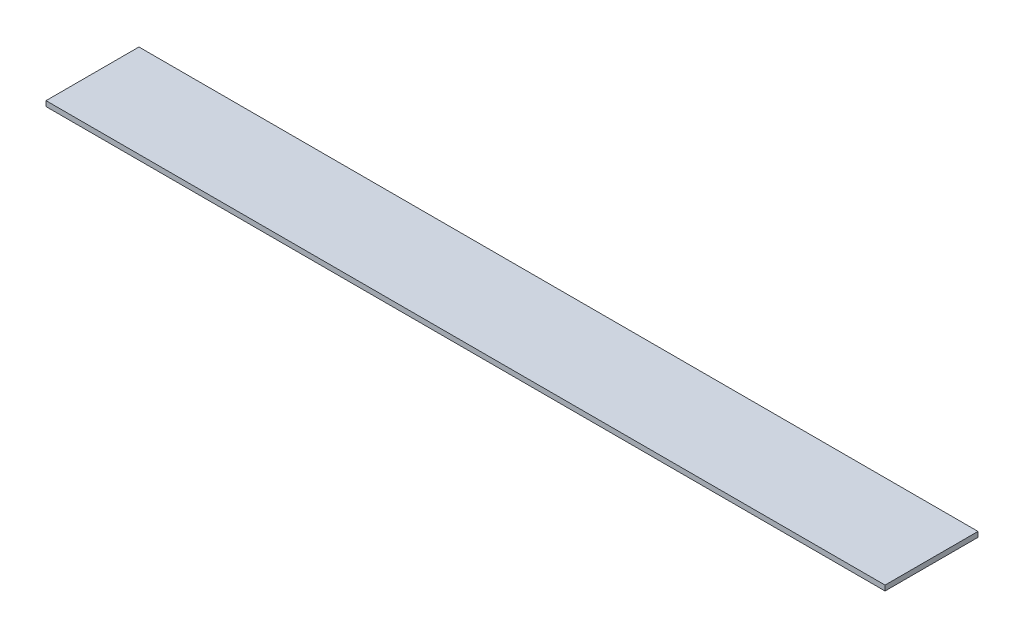
ISO-10303-21;
HEADER;
FILE_DESCRIPTION(('STEP AP214'),'2;1');
FILE_NAME('part.step','',(''),(''),'','','');
FILE_SCHEMA(('AUTOMOTIVE_DESIGN { 1 0 10303 214 1 1 1 1 }'));
ENDSEC;
DATA;
#1=APPLICATION_CONTEXT('core data for automotive mechanical design processes');
#2=APPLICATION_PROTOCOL_DEFINITION('international standard','automotive_design',2000,#1);
#3=PRODUCT_CONTEXT('',#1,'mechanical');
#4=PRODUCT('Part','Part','',(#3));
#5=PRODUCT_RELATED_PRODUCT_CATEGORY('part','',(#4));
#6=PRODUCT_DEFINITION_FORMATION('','',#4);
#7=PRODUCT_DEFINITION_CONTEXT('part definition',#1,'design');
#8=PRODUCT_DEFINITION('design','',#6,#7);
#9=PRODUCT_DEFINITION_SHAPE('','',#8);
#10=(LENGTH_UNIT() NAMED_UNIT(*) SI_UNIT(.MILLI.,.METRE.));
#11=(NAMED_UNIT(*) PLANE_ANGLE_UNIT() SI_UNIT($,.RADIAN.));
#12=(NAMED_UNIT(*) SI_UNIT($,.STERADIAN.) SOLID_ANGLE_UNIT());
#13=UNCERTAINTY_MEASURE_WITH_UNIT(LENGTH_MEASURE(1.E-05),#10,'distance_accuracy_value','');
#14=(GEOMETRIC_REPRESENTATION_CONTEXT(3) GLOBAL_UNCERTAINTY_ASSIGNED_CONTEXT((#13)) GLOBAL_UNIT_ASSIGNED_CONTEXT((#10,
#11,#12)) REPRESENTATION_CONTEXT('',''));
#15=CARTESIAN_POINT('',(0.,0.,0.));
#16=DIRECTION('',(0.,0.,1.));
#17=DIRECTION('',(1.,0.,0.));
#18=AXIS2_PLACEMENT_3D('',#15,#16,#17);
#19=CARTESIAN_POINT('',(162.5,-2.,18.));
#20=DIRECTION('',(0.,1.,0.));
#21=DIRECTION('',(0.,0.,1.));
#22=AXIS2_PLACEMENT_3D('',#19,#20,#21);
#23=PLANE('',#22);
#24=DIRECTION('',(0.,0.,-1.));
#25=VECTOR('',#24,1.);
#26=CARTESIAN_POINT('',(-162.5,-2.,18.));
#27=LINE('',#26,#25);
#28=CARTESIAN_POINT('',(-162.5,-2.,18.));
#29=VERTEX_POINT('',#28);
#30=CARTESIAN_POINT('',(-162.5,-2.,-18.));
#31=VERTEX_POINT('',#30);
#32=EDGE_CURVE('E98',#29,#31,#27,.T.);
#33=ORIENTED_EDGE('',*,*,#32,.T.);
#34=DIRECTION('',(-1.,0.,0.));
#35=VECTOR('',#34,1.);
#36=CARTESIAN_POINT('',(162.5,-2.,-18.));
#37=LINE('',#36,#35);
#38=CARTESIAN_POINT('',(162.5,-2.,-18.));
#39=VERTEX_POINT('',#38);
#40=EDGE_CURVE('E11',#39,#31,#37,.T.);
#41=ORIENTED_EDGE('',*,*,#40,.F.);
#42=DIRECTION('',(0.,0.,-1.));
#43=VECTOR('',#42,1.);
#44=CARTESIAN_POINT('',(162.5,-2.,18.));
#45=LINE('',#44,#43);
#46=CARTESIAN_POINT('',(162.5,-2.,18.));
#47=VERTEX_POINT('',#46);
#48=EDGE_CURVE('E75',#47,#39,#45,.T.);
#49=ORIENTED_EDGE('',*,*,#48,.F.);
#50=DIRECTION('',(-1.,0.,0.));
#51=VECTOR('',#50,1.);
#52=CARTESIAN_POINT('',(162.5,-2.,18.));
#53=LINE('',#52,#51);
#54=EDGE_CURVE('E51',#47,#29,#53,.T.);
#55=ORIENTED_EDGE('',*,*,#54,.T.);
#56=EDGE_LOOP('',(#33,#41,#49,#55));
#57=FACE_BOUND('',#56,.T.);
#58=ADVANCED_FACE('F35',(#57),#23,.F.);
#59=CARTESIAN_POINT('',(162.5,0.,-18.));
#60=DIRECTION('',(0.,0.,-1.));
#61=DIRECTION('',(-1.,0.,0.));
#62=AXIS2_PLACEMENT_3D('',#59,#60,#61);
#63=PLANE('',#62);
#64=DIRECTION('',(0.,-1.,0.));
#65=VECTOR('',#64,1.);
#66=CARTESIAN_POINT('',(-162.5,0.,-18.));
#67=LINE('',#66,#65);
#68=CARTESIAN_POINT('',(-162.5,0.,-18.));
#69=VERTEX_POINT('',#68);
#70=EDGE_CURVE('E84',#69,#31,#67,.T.);
#71=ORIENTED_EDGE('',*,*,#70,.F.);
#72=DIRECTION('',(-1.,0.,0.));
#73=VECTOR('',#72,1.);
#74=CARTESIAN_POINT('',(162.5,0.,-18.));
#75=LINE('',#74,#73);
#76=CARTESIAN_POINT('',(162.5,0.,-18.));
#77=VERTEX_POINT('',#76);
#78=EDGE_CURVE('E43',#77,#69,#75,.T.);
#79=ORIENTED_EDGE('',*,*,#78,.F.);
#80=DIRECTION('',(0.,-1.,0.));
#81=VECTOR('',#80,1.);
#82=CARTESIAN_POINT('',(162.5,0.,-18.));
#83=LINE('',#82,#81);
#84=EDGE_CURVE('E82',#77,#39,#83,.T.);
#85=ORIENTED_EDGE('',*,*,#84,.T.);
#86=ORIENTED_EDGE('',*,*,#40,.T.);
#87=EDGE_LOOP('',(#71,#79,#85,#86));
#88=FACE_BOUND('',#87,.T.);
#89=ADVANCED_FACE('F81',(#88),#63,.T.);
#90=CARTESIAN_POINT('',(162.5,0.,18.));
#91=DIRECTION('',(0.,1.,0.));
#92=DIRECTION('',(0.,0.,1.));
#93=AXIS2_PLACEMENT_3D('',#90,#91,#92);
#94=PLANE('',#93);
#95=DIRECTION('',(0.,0.,-1.));
#96=VECTOR('',#95,1.);
#97=CARTESIAN_POINT('',(-162.5,0.,18.));
#98=LINE('',#97,#96);
#99=CARTESIAN_POINT('',(-162.5,0.,18.));
#100=VERTEX_POINT('',#99);
#101=EDGE_CURVE('E101',#100,#69,#98,.T.);
#102=ORIENTED_EDGE('',*,*,#101,.F.);
#103=DIRECTION('',(-1.,0.,0.));
#104=VECTOR('',#103,1.);
#105=CARTESIAN_POINT('',(162.5,0.,18.));
#106=LINE('',#105,#104);
#107=CARTESIAN_POINT('',(162.5,0.,18.));
#108=VERTEX_POINT('',#107);
#109=EDGE_CURVE('E64',#108,#100,#106,.T.);
#110=ORIENTED_EDGE('',*,*,#109,.F.);
#111=DIRECTION('',(0.,0.,-1.));
#112=VECTOR('',#111,1.);
#113=CARTESIAN_POINT('',(162.5,0.,18.));
#114=LINE('',#113,#112);
#115=EDGE_CURVE('E90',#108,#77,#114,.T.);
#116=ORIENTED_EDGE('',*,*,#115,.T.);
#117=ORIENTED_EDGE('',*,*,#78,.T.);
#118=EDGE_LOOP('',(#102,#110,#116,#117));
#119=FACE_BOUND('',#118,.T.);
#120=ADVANCED_FACE('F92',(#119),#94,.T.);
#121=CARTESIAN_POINT('',(162.5,-2.,18.));
#122=DIRECTION('',(0.,0.,1.));
#123=DIRECTION('',(1.,0.,0.));
#124=AXIS2_PLACEMENT_3D('',#121,#122,#123);
#125=PLANE('',#124);
#126=DIRECTION('',(0.,1.,0.));
#127=VECTOR('',#126,1.);
#128=CARTESIAN_POINT('',(-162.5,-2.,18.));
#129=LINE('',#128,#127);
#130=EDGE_CURVE('E103',#29,#100,#129,.T.);
#131=ORIENTED_EDGE('',*,*,#130,.F.);
#132=ORIENTED_EDGE('',*,*,#54,.F.);
#133=DIRECTION('',(0.,1.,0.));
#134=VECTOR('',#133,1.);
#135=CARTESIAN_POINT('',(162.5,-2.,18.));
#136=LINE('',#135,#134);
#137=EDGE_CURVE('E93',#47,#108,#136,.T.);
#138=ORIENTED_EDGE('',*,*,#137,.T.);
#139=ORIENTED_EDGE('',*,*,#109,.T.);
#140=EDGE_LOOP('',(#131,#132,#138,#139));
#141=FACE_BOUND('',#140,.T.);
#142=ADVANCED_FACE('F109',(#141),#125,.T.);
#143=CARTESIAN_POINT('',(162.5,-2.,-18.));
#144=DIRECTION('',(-1.,0.,0.));
#145=DIRECTION('',(0.,0.,1.));
#146=AXIS2_PLACEMENT_3D('',#143,#144,#145);
#147=PLANE('',#146);
#148=ORIENTED_EDGE('',*,*,#48,.T.);
#149=ORIENTED_EDGE('',*,*,#84,.F.);
#150=ORIENTED_EDGE('',*,*,#115,.F.);
#151=ORIENTED_EDGE('',*,*,#137,.F.);
#152=EDGE_LOOP('',(#148,#149,#150,#151));
#153=FACE_BOUND('',#152,.T.);
#154=ADVANCED_FACE('F89',(#153),#147,.F.);
#155=CARTESIAN_POINT('',(-162.5,-2.,-18.));
#156=DIRECTION('',(-1.,0.,0.));
#157=DIRECTION('',(0.,0.,1.));
#158=AXIS2_PLACEMENT_3D('',#155,#156,#157);
#159=PLANE('',#158);
#160=ORIENTED_EDGE('',*,*,#32,.F.);
#161=ORIENTED_EDGE('',*,*,#130,.T.);
#162=ORIENTED_EDGE('',*,*,#101,.T.);
#163=ORIENTED_EDGE('',*,*,#70,.T.);
#164=EDGE_LOOP('',(#160,#161,#162,#163));
#165=FACE_BOUND('',#164,.T.);
#166=ADVANCED_FACE('F108',(#165),#159,.T.);
#167=CLOSED_SHELL('',(#58,#89,#120,#142,#154,#166));
#168=MANIFOLD_SOLID_BREP('B2',#167);
#169=ADVANCED_BREP_SHAPE_REPRESENTATION('',(#18,#168),#14);
#170=SHAPE_DEFINITION_REPRESENTATION(#9,#169);
ENDSEC;
END-ISO-10303-21;
